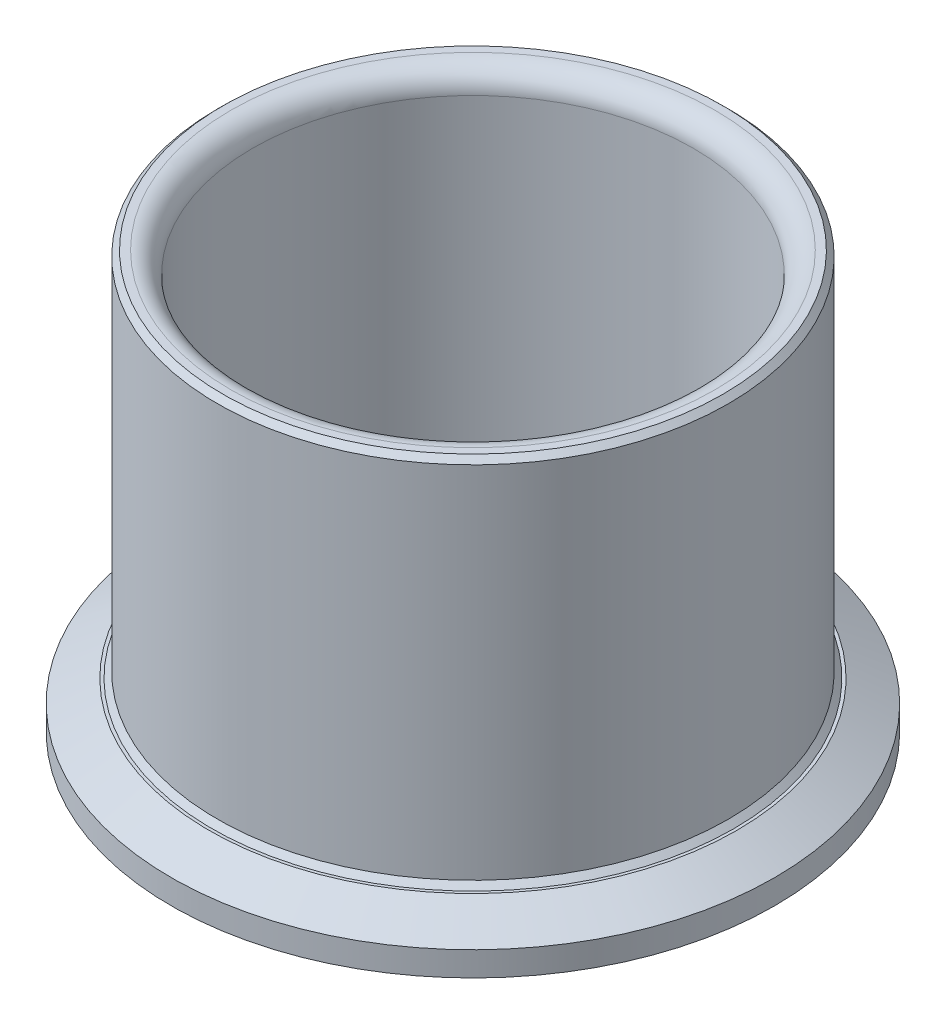
ISO-10303-21;
HEADER;
FILE_DESCRIPTION(('STEP AP214'),'2;1');
FILE_NAME('part.step','',(''),(''),'','','');
FILE_SCHEMA(('AUTOMOTIVE_DESIGN { 1 0 10303 214 1 1 1 1 }'));
ENDSEC;
DATA;
#1=APPLICATION_CONTEXT('core data for automotive mechanical design processes');
#2=APPLICATION_PROTOCOL_DEFINITION('international standard','automotive_design',2000,#1);
#3=PRODUCT_CONTEXT('',#1,'mechanical');
#4=PRODUCT('Part','Part','',(#3));
#5=PRODUCT_RELATED_PRODUCT_CATEGORY('part','',(#4));
#6=PRODUCT_DEFINITION_FORMATION('','',#4);
#7=PRODUCT_DEFINITION_CONTEXT('part definition',#1,'design');
#8=PRODUCT_DEFINITION('design','',#6,#7);
#9=PRODUCT_DEFINITION_SHAPE('','',#8);
#10=(LENGTH_UNIT() NAMED_UNIT(*) SI_UNIT(.MILLI.,.METRE.));
#11=(NAMED_UNIT(*) PLANE_ANGLE_UNIT() SI_UNIT($,.RADIAN.));
#12=(NAMED_UNIT(*) SI_UNIT($,.STERADIAN.) SOLID_ANGLE_UNIT());
#13=UNCERTAINTY_MEASURE_WITH_UNIT(LENGTH_MEASURE(1.E-05),#10,'distance_accuracy_value','');
#14=(GEOMETRIC_REPRESENTATION_CONTEXT(3) GLOBAL_UNCERTAINTY_ASSIGNED_CONTEXT((#13)) GLOBAL_UNIT_ASSIGNED_CONTEXT((#10,
#11,#12)) REPRESENTATION_CONTEXT('',''));
#15=CARTESIAN_POINT('',(0.,0.,0.));
#16=DIRECTION('',(0.,0.,1.));
#17=DIRECTION('',(1.,0.,0.));
#18=AXIS2_PLACEMENT_3D('',#15,#16,#17);
#19=CARTESIAN_POINT('',(-31.75,0.,0.));
#20=DIRECTION('',(0.,1.,0.));
#21=DIRECTION('',(-1.,0.,0.));
#22=AXIS2_PLACEMENT_3D('',#19,#20,#21);
#23=PLANE('',#22);
#24=CARTESIAN_POINT('',(0.,0.,0.));
#25=DIRECTION('',(0.,1.,0.));
#26=DIRECTION('',(-1.,0.,0.));
#27=AXIS2_PLACEMENT_3D('',#24,#25,#26);
#28=CIRCLE('',#27,30.175);
#29=CARTESIAN_POINT('',(-30.175,0.,0.));
#30=VERTEX_POINT('',#29);
#31=EDGE_CURVE('E71',#30,#30,#28,.T.);
#32=ORIENTED_EDGE('',*,*,#31,.T.);
#33=EDGE_LOOP('',(#32));
#34=FACE_BOUND('',#33,.T.);
#35=CARTESIAN_POINT('',(0.,0.,0.));
#36=DIRECTION('',(0.,-1.,0.));
#37=DIRECTION('',(1.,0.,0.));
#38=AXIS2_PLACEMENT_3D('',#35,#36,#37);
#39=CIRCLE('',#38,31.75);
#40=CARTESIAN_POINT('',(31.75,0.,0.));
#41=VERTEX_POINT('',#40);
#42=EDGE_CURVE('E68',#41,#41,#39,.T.);
#43=ORIENTED_EDGE('',*,*,#42,.T.);
#44=EDGE_LOOP('',(#43));
#45=FACE_BOUND('',#44,.T.);
#46=ADVANCED_FACE('F30',(#34,#45),#23,.F.);
#47=CARTESIAN_POINT('',(0.,58.15,0.));
#48=DIRECTION('',(0.,-1.,0.));
#49=DIRECTION('',(1.,0.,0.));
#50=AXIS2_PLACEMENT_3D('',#47,#48,#49);
#51=PLANE('',#50);
#52=CARTESIAN_POINT('',(0.,58.15,0.));
#53=DIRECTION('',(0.,-1.,0.));
#54=DIRECTION('',(1.,0.,0.));
#55=AXIS2_PLACEMENT_3D('',#52,#53,#54);
#56=CIRCLE('',#55,33.175);
#57=CARTESIAN_POINT('',(33.175,58.15,0.));
#58=VERTEX_POINT('',#57);
#59=EDGE_CURVE('E10',#58,#58,#56,.T.);
#60=ORIENTED_EDGE('',*,*,#59,.T.);
#61=EDGE_LOOP('',(#60));
#62=FACE_BOUND('',#61,.T.);
#63=CARTESIAN_POINT('',(0.,58.15,0.));
#64=DIRECTION('',(0.,-1.,0.));
#65=DIRECTION('',(1.,0.,0.));
#66=AXIS2_PLACEMENT_3D('',#63,#64,#65);
#67=CIRCLE('',#66,34.25);
#68=CARTESIAN_POINT('',(34.25,58.15,0.));
#69=VERTEX_POINT('',#68);
#70=EDGE_CURVE('E53',#69,#69,#67,.F.);
#71=ORIENTED_EDGE('',*,*,#70,.T.);
#72=EDGE_LOOP('',(#71));
#73=FACE_BOUND('',#72,.T.);
#74=ADVANCED_FACE('F93',(#62,#73),#51,.F.);
#75=CARTESIAN_POINT('',(0.,0.,0.));
#76=DIRECTION('',(0.,-1.,0.));
#77=DIRECTION('',(1.,0.,0.));
#78=AXIS2_PLACEMENT_3D('',#75,#76,#77);
#79=CYLINDRICAL_SURFACE('',#78,35.);
#80=CARTESIAN_POINT('',(0.,57.4,0.));
#81=DIRECTION('',(0.,-1.,0.));
#82=DIRECTION('',(1.,0.,0.));
#83=AXIS2_PLACEMENT_3D('',#80,#81,#82);
#84=CIRCLE('',#83,35.);
#85=CARTESIAN_POINT('',(35.,57.4,0.));
#86=VERTEX_POINT('',#85);
#87=EDGE_CURVE('E56',#86,#86,#84,.T.);
#88=ORIENTED_EDGE('',*,*,#87,.T.);
#89=EDGE_LOOP('',(#88));
#90=FACE_BOUND('',#89,.T.);
#91=CARTESIAN_POINT('',(0.,8.10000000000006,0.));
#92=DIRECTION('',(0.,-1.,0.));
#93=DIRECTION('',(1.,0.,0.));
#94=AXIS2_PLACEMENT_3D('',#91,#92,#93);
#95=CIRCLE('',#94,35.);
#96=CARTESIAN_POINT('',(35.,8.10000000000007,0.));
#97=VERTEX_POINT('',#96);
#98=EDGE_CURVE('E59',#97,#97,#95,.F.);
#99=ORIENTED_EDGE('',*,*,#98,.T.);
#100=EDGE_LOOP('',(#99));
#101=FACE_BOUND('',#100,.T.);
#102=ADVANCED_FACE('F98',(#90,#101),#79,.T.);
#103=CARTESIAN_POINT('',(-35.,7.35,0.));
#104=DIRECTION('',(0.,-1.,0.));
#105=DIRECTION('',(1.,0.,0.));
#106=AXIS2_PLACEMENT_3D('',#103,#104,#105);
#107=PLANE('',#106);
#108=CARTESIAN_POINT('',(0.,7.35000000000002,0.));
#109=DIRECTION('',(0.,-1.,0.));
#110=DIRECTION('',(1.,0.,0.));
#111=AXIS2_PLACEMENT_3D('',#108,#109,#110);
#112=CIRCLE('',#111,36.1538475772934);
#113=CARTESIAN_POINT('',(36.1538475772934,7.35000000000003,0.));
#114=VERTEX_POINT('',#113);
#115=EDGE_CURVE('E41',#114,#114,#112,.F.);
#116=ORIENTED_EDGE('',*,*,#115,.T.);
#117=EDGE_LOOP('',(#116));
#118=FACE_BOUND('',#117,.T.);
#119=CARTESIAN_POINT('',(0.,7.35000000000002,0.));
#120=DIRECTION('',(0.,-1.,0.));
#121=DIRECTION('',(1.,0.,0.));
#122=AXIS2_PLACEMENT_3D('',#119,#120,#121);
#123=CIRCLE('',#122,35.75);
#124=CARTESIAN_POINT('',(35.75,7.35000000000003,0.));
#125=VERTEX_POINT('',#124);
#126=EDGE_CURVE('E50',#125,#125,#123,.T.);
#127=ORIENTED_EDGE('',*,*,#126,.T.);
#128=EDGE_LOOP('',(#127));
#129=FACE_BOUND('',#128,.T.);
#130=ADVANCED_FACE('F118',(#118,#129),#107,.F.);
#131=CARTESIAN_POINT('',(0.,0.,0.));
#132=DIRECTION('',(0.,-1.,0.));
#133=DIRECTION('',(1.,0.,0.));
#134=AXIS2_PLACEMENT_3D('',#131,#132,#133);
#135=CYLINDRICAL_SURFACE('',#134,41.35);
#136=CARTESIAN_POINT('',(0.,4.34999999999998,0.));
#137=DIRECTION('',(0.,-1.,0.));
#138=DIRECTION('',(1.,0.,0.));
#139=AXIS2_PLACEMENT_3D('',#136,#137,#138);
#140=CIRCLE('',#139,41.35);
#141=CARTESIAN_POINT('',(41.35,4.35,0.));
#142=VERTEX_POINT('',#141);
#143=EDGE_CURVE('E45',#142,#142,#140,.T.);
#144=ORIENTED_EDGE('',*,*,#143,.T.);
#145=EDGE_LOOP('',(#144));
#146=FACE_BOUND('',#145,.T.);
#147=CARTESIAN_POINT('',(0.,1.00000000000002,0.));
#148=DIRECTION('',(0.,-1.,0.));
#149=DIRECTION('',(1.,0.,0.));
#150=AXIS2_PLACEMENT_3D('',#147,#148,#149);
#151=CIRCLE('',#150,41.35);
#152=CARTESIAN_POINT('',(41.35,1.00000000000003,0.));
#153=VERTEX_POINT('',#152);
#154=EDGE_CURVE('E62',#153,#153,#151,.T.);
#155=ORIENTED_EDGE('',*,*,#154,.F.);
#156=EDGE_LOOP('',(#155));
#157=FACE_BOUND('',#156,.T.);
#158=ADVANCED_FACE('F115',(#146,#157),#135,.T.);
#159=CARTESIAN_POINT('',(-41.35,0.999999999999999,0.));
#160=DIRECTION('',(0.,1.,0.));
#161=DIRECTION('',(-1.,0.,0.));
#162=AXIS2_PLACEMENT_3D('',#159,#160,#161);
#163=PLANE('',#162);
#164=CARTESIAN_POINT('',(0.,1.00000000000001,0.));
#165=DIRECTION('',(0.,-1.,0.));
#166=DIRECTION('',(1.,0.,0.));
#167=AXIS2_PLACEMENT_3D('',#164,#165,#166);
#168=CIRCLE('',#167,31.75);
#169=CARTESIAN_POINT('',(31.75,1.00000000000002,0.));
#170=VERTEX_POINT('',#169);
#171=EDGE_CURVE('E65',#170,#170,#168,.T.);
#172=ORIENTED_EDGE('',*,*,#171,.F.);
#173=EDGE_LOOP('',(#172));
#174=FACE_BOUND('',#173,.T.);
#175=ORIENTED_EDGE('',*,*,#154,.T.);
#176=EDGE_LOOP('',(#175));
#177=FACE_BOUND('',#176,.T.);
#178=ADVANCED_FACE('F89',(#174,#177),#163,.F.);
#179=CARTESIAN_POINT('',(0.,0.,0.));
#180=DIRECTION('',(0.,-1.,0.));
#181=DIRECTION('',(1.,0.,0.));
#182=AXIS2_PLACEMENT_3D('',#179,#180,#181);
#183=CYLINDRICAL_SURFACE('',#182,31.75);
#184=ORIENTED_EDGE('',*,*,#42,.F.);
#185=EDGE_LOOP('',(#184));
#186=FACE_BOUND('',#185,.T.);
#187=ORIENTED_EDGE('',*,*,#171,.T.);
#188=EDGE_LOOP('',(#187));
#189=FACE_BOUND('',#188,.T.);
#190=ADVANCED_FACE('F80',(#186,#189),#183,.T.);
#191=CARTESIAN_POINT('',(0.,0.,0.));
#192=DIRECTION('',(0.,1.,0.));
#193=DIRECTION('',(-1.,0.,0.));
#194=AXIS2_PLACEMENT_3D('',#191,#192,#193);
#195=CYLINDRICAL_SURFACE('',#194,30.175);
#196=CARTESIAN_POINT('',(0.,55.15,0.));
#197=DIRECTION('',(0.,-1.,0.));
#198=DIRECTION('',(1.,0.,0.));
#199=AXIS2_PLACEMENT_3D('',#196,#197,#198);
#200=CIRCLE('',#199,30.175);
#201=CARTESIAN_POINT('',(30.175,55.15,0.));
#202=VERTEX_POINT('',#201);
#203=EDGE_CURVE('E37',#202,#202,#200,.F.);
#204=ORIENTED_EDGE('',*,*,#203,.T.);
#205=EDGE_LOOP('',(#204));
#206=FACE_BOUND('',#205,.T.);
#207=ORIENTED_EDGE('',*,*,#31,.F.);
#208=EDGE_LOOP('',(#207));
#209=FACE_BOUND('',#208,.T.);
#210=ADVANCED_FACE('F77',(#206,#209),#195,.F.);
#211=CARTESIAN_POINT('',(0.,57.4,0.));
#212=DIRECTION('',(0.,-1.,0.));
#213=DIRECTION('',(1.,0.,0.));
#214=AXIS2_PLACEMENT_3D('',#211,#212,#213);
#215=CONICAL_SURFACE('',#214,35.,0.785398163397434);
#216=ORIENTED_EDGE('',*,*,#70,.F.);
#217=EDGE_LOOP('',(#216));
#218=FACE_BOUND('',#217,.T.);
#219=ORIENTED_EDGE('',*,*,#87,.F.);
#220=EDGE_LOOP('',(#219));
#221=FACE_BOUND('',#220,.T.);
#222=ADVANCED_FACE('F79',(#218,#221),#215,.T.);
#223=CARTESIAN_POINT('',(0.,7.35000000000002,0.));
#224=DIRECTION('',(0.,-1.,0.));
#225=DIRECTION('',(1.,0.,0.));
#226=AXIS2_PLACEMENT_3D('',#223,#224,#225);
#227=CONICAL_SURFACE('',#226,35.75,0.785398163397454);
#228=ORIENTED_EDGE('',*,*,#98,.F.);
#229=EDGE_LOOP('',(#228));
#230=FACE_BOUND('',#229,.T.);
#231=ORIENTED_EDGE('',*,*,#126,.F.);
#232=EDGE_LOOP('',(#231));
#233=FACE_BOUND('',#232,.T.);
#234=ADVANCED_FACE('F86',(#230,#233),#227,.T.);
#235=CARTESIAN_POINT('',(0.,4.34999999999998,0.));
#236=DIRECTION('',(0.,-1.,0.));
#237=DIRECTION('',(1.,0.,0.));
#238=AXIS2_PLACEMENT_3D('',#235,#236,#237);
#239=CONICAL_SURFACE('',#238,41.35,1.04719755119659);
#240=ORIENTED_EDGE('',*,*,#115,.F.);
#241=EDGE_LOOP('',(#240));
#242=FACE_BOUND('',#241,.T.);
#243=ORIENTED_EDGE('',*,*,#143,.F.);
#244=EDGE_LOOP('',(#243));
#245=FACE_BOUND('',#244,.T.);
#246=ADVANCED_FACE('F103',(#242,#245),#239,.T.);
#247=CARTESIAN_POINT('',(0.,55.15,0.));
#248=DIRECTION('',(0.,-1.,0.));
#249=DIRECTION('',(1.,0.,0.));
#250=AXIS2_PLACEMENT_3D('',#247,#248,#249);
#251=TOROIDAL_SURFACE('',#250,33.175,3.);
#252=ORIENTED_EDGE('',*,*,#59,.F.);
#253=EDGE_LOOP('',(#252));
#254=FACE_BOUND('',#253,.T.);
#255=ORIENTED_EDGE('',*,*,#203,.F.);
#256=EDGE_LOOP('',(#255));
#257=FACE_BOUND('',#256,.T.);
#258=ADVANCED_FACE('F32',(#254,#257),#251,.T.);
#259=CLOSED_SHELL('',(#46,#74,#102,#130,#158,#178,#190,#210,#222,#234,#246,#258));
#260=MANIFOLD_SOLID_BREP('B2',#259);
#261=ADVANCED_BREP_SHAPE_REPRESENTATION('',(#18,#260),#14);
#262=SHAPE_DEFINITION_REPRESENTATION(#9,#261);
ENDSEC;
END-ISO-10303-21;
